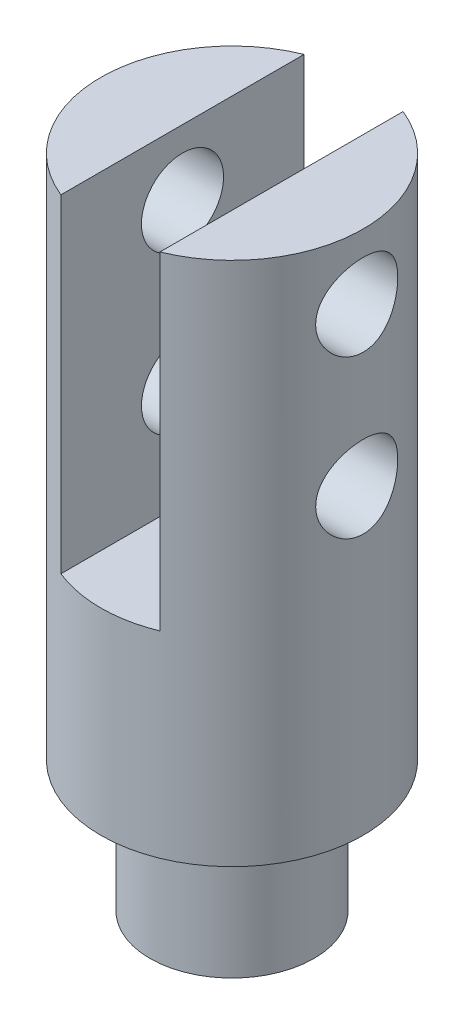
ISO-10303-21;
HEADER;
FILE_DESCRIPTION(('STEP AP214'),'2;1');
FILE_NAME('part.step','',(''),(''),'','','');
FILE_SCHEMA(('AUTOMOTIVE_DESIGN { 1 0 10303 214 1 1 1 1 }'));
ENDSEC;
DATA;
#1=APPLICATION_CONTEXT('core data for automotive mechanical design processes');
#2=APPLICATION_PROTOCOL_DEFINITION('international standard','automotive_design',2000,#1);
#3=PRODUCT_CONTEXT('',#1,'mechanical');
#4=PRODUCT('Part','Part','',(#3));
#5=PRODUCT_RELATED_PRODUCT_CATEGORY('part','',(#4));
#6=PRODUCT_DEFINITION_FORMATION('','',#4);
#7=PRODUCT_DEFINITION_CONTEXT('part definition',#1,'design');
#8=PRODUCT_DEFINITION('design','',#6,#7);
#9=PRODUCT_DEFINITION_SHAPE('','',#8);
#10=(LENGTH_UNIT() NAMED_UNIT(*) SI_UNIT(.MILLI.,.METRE.));
#11=(NAMED_UNIT(*) PLANE_ANGLE_UNIT() SI_UNIT($,.RADIAN.));
#12=(NAMED_UNIT(*) SI_UNIT($,.STERADIAN.) SOLID_ANGLE_UNIT());
#13=UNCERTAINTY_MEASURE_WITH_UNIT(LENGTH_MEASURE(1.E-05),#10,'distance_accuracy_value','');
#14=(GEOMETRIC_REPRESENTATION_CONTEXT(3) GLOBAL_UNCERTAINTY_ASSIGNED_CONTEXT((#13)) GLOBAL_UNIT_ASSIGNED_CONTEXT((#10,
#11,#12)) REPRESENTATION_CONTEXT('',''));
#15=CARTESIAN_POINT('',(0.,0.,0.));
#16=DIRECTION('',(0.,0.,1.));
#17=DIRECTION('',(1.,0.,0.));
#18=AXIS2_PLACEMENT_3D('',#15,#16,#17);
#19=CARTESIAN_POINT('',(0.,0.,0.));
#20=DIRECTION('',(0.,1.,0.));
#21=DIRECTION('',(0.,0.,1.));
#22=AXIS2_PLACEMENT_3D('',#19,#20,#21);
#23=PLANE('',#22);
#24=DIRECTION('',(0.,0.,-1.));
#25=VECTOR('',#24,1.);
#26=CARTESIAN_POINT('',(4.7879,0.,26.2227099301437));
#27=LINE('',#26,#25);
#28=CARTESIAN_POINT('',(4.7879,0.,11.7629083814336));
#29=VERTEX_POINT('',#28);
#30=CARTESIAN_POINT('',(4.7879,0.,-11.7629083814336));
#31=VERTEX_POINT('',#30);
#32=EDGE_CURVE('E89',#29,#31,#27,.T.);
#33=ORIENTED_EDGE('',*,*,#32,.F.);
#34=CARTESIAN_POINT('',(0.,0.,0.));
#35=DIRECTION('',(0.,1.,0.));
#36=DIRECTION('',(0.,0.,1.));
#37=AXIS2_PLACEMENT_3D('',#34,#35,#36);
#38=CIRCLE('',#37,12.7);
#39=EDGE_CURVE('E96',#29,#31,#38,.T.);
#40=ORIENTED_EDGE('',*,*,#39,.T.);
#41=EDGE_LOOP('',(#33,#40));
#42=FACE_BOUND('',#41,.T.);
#43=ADVANCED_FACE('F46',(#42),#23,.T.);
#44=DIRECTION('',(0.,0.,1.));
#45=VECTOR('',#44,1.);
#46=CARTESIAN_POINT('',(-4.7879,0.,26.2227099301437));
#47=LINE('',#46,#45);
#48=CARTESIAN_POINT('',(-4.7879,0.,-11.7629083814336));
#49=VERTEX_POINT('',#48);
#50=CARTESIAN_POINT('',(-4.7879,0.,11.7629083814336));
#51=VERTEX_POINT('',#50);
#52=EDGE_CURVE('E97',#49,#51,#47,.T.);
#53=ORIENTED_EDGE('',*,*,#52,.F.);
#54=EDGE_CURVE('E105',#49,#51,#38,.T.);
#55=ORIENTED_EDGE('',*,*,#54,.T.);
#56=EDGE_LOOP('',(#53,#55));
#57=FACE_BOUND('',#56,.T.);
#58=ADVANCED_FACE('F48',(#57),#23,.T.);
#59=CARTESIAN_POINT('',(0.,54.1051229508197,0.));
#60=DIRECTION('',(0.,1.,0.));
#61=DIRECTION('',(0.,0.,1.));
#62=AXIS2_PLACEMENT_3D('',#59,#60,#61);
#63=CYLINDRICAL_SURFACE('',#62,12.7);
#64=CARTESIAN_POINT('',(-12.7,-2.37744,0.));
#65=CARTESIAN_POINT('',(-12.6999989364852,-2.37744138791249,-0.217492557763878));
#66=CARTESIAN_POINT('',(-12.6943603110892,-2.39536000112773,-0.43499970457634));
#67=CARTESIAN_POINT('',(-12.6724191916379,-2.46637270695974,-0.863652552627288));
#68=CARTESIAN_POINT('',(-12.6561143024,-2.51947470027949,-1.07479681389357));
#69=CARTESIAN_POINT('',(-12.6146217111831,-2.6588878067983,-1.48448068440005));
#70=CARTESIAN_POINT('',(-12.5894477791866,-2.74514745856465,-1.68303927334254));
#71=CARTESIAN_POINT('',(-12.5328159290258,-2.94820815004892,-2.06287399242892));
#72=CARTESIAN_POINT('',(-12.5013570171812,-3.06501402014844,-2.2441473830109));
#73=CARTESIAN_POINT('',(-12.434405504797,-3.32965530098341,-2.58987502339287));
#74=CARTESIAN_POINT('',(-12.3988248999794,-3.47826499988978,-2.75371947787847));
#75=CARTESIAN_POINT('',(-12.3281495374864,-3.80064685931324,-3.05461377606018));
#76=CARTESIAN_POINT('',(-12.2930548716153,-3.97442370525733,-3.19165861921905));
#77=CARTESIAN_POINT('',(-12.2263802746652,-4.34748898232327,-3.43837247280718));
#78=CARTESIAN_POINT('',(-12.1949089417569,-4.54730273264139,-3.54727926216575));
#79=CARTESIAN_POINT('',(-12.1403681406173,-4.96355279542945,-3.72969053094531));
#80=CARTESIAN_POINT('',(-12.1172964547123,-5.17998470207569,-3.80320435646769));
#81=CARTESIAN_POINT('',(-12.0830878271828,-5.61644554014773,-3.91051080755888));
#82=CARTESIAN_POINT('',(-12.0716118578883,-5.83616901477066,-3.94543476323751));
#83=CARTESIAN_POINT('',(-12.0608874846081,-6.27863327561589,-3.97810456397336));
#84=CARTESIAN_POINT('',(-12.0616358227427,-6.50137324210696,-3.97586031466403));
#85=CARTESIAN_POINT('',(-12.0749762843099,-6.93418525877417,-3.93514217597677));
#86=CARTESIAN_POINT('',(-12.087098059951,-7.1444095994836,-3.89810699023441));
#87=CARTESIAN_POINT('',(-12.1210554098322,-7.55549695839661,-3.79119112966301));
#88=CARTESIAN_POINT('',(-12.142892018231,-7.75635897745129,-3.72130695796479));
#89=CARTESIAN_POINT('',(-12.1941787219778,-8.14644504195209,-3.54966190182948));
#90=CARTESIAN_POINT('',(-12.2237355296374,-8.33545582985697,-3.44744961529387));
#91=CARTESIAN_POINT('',(-12.2870834938587,-8.69411470789891,-3.21436326003549));
#92=CARTESIAN_POINT('',(-12.3208757511563,-8.86375774263885,-3.08348173393025));
#93=CARTESIAN_POINT('',(-12.3907734671559,-9.1869984375376,-2.78971448911799));
#94=CARTESIAN_POINT('',(-12.4269141304001,-9.33951122177774,-2.62564123753074));
#95=CARTESIAN_POINT('',(-12.496077188252,-9.61512130845667,-2.27379788611728));
#96=CARTESIAN_POINT('',(-12.5290993508445,-9.73821642327437,-2.08602602554894));
#97=CARTESIAN_POINT('',(-12.5886526113865,-9.95223396566114,-1.69002189927923));
#98=CARTESIAN_POINT('',(-12.615130911478,-10.0428971859756,-1.48164107002917));
#99=CARTESIAN_POINT('',(-12.6582318933316,-10.187560916962,-1.05156492180258));
#100=CARTESIAN_POINT('',(-12.6748575734968,-10.241572582362,-0.829873676166752));
#101=CARTESIAN_POINT('',(-12.6958973744177,-10.3095509256056,-0.388678056186915));
#102=CARTESIAN_POINT('',(-12.7007591131408,-10.3249862243419,-0.169420979767007));
#103=CARTESIAN_POINT('',(-12.699047355392,-10.3195150470694,0.268574231623304));
#104=CARTESIAN_POINT('',(-12.6924755329623,-10.2986138912544,0.487312437868517));
#105=CARTESIAN_POINT('',(-12.6689292134884,-10.2222418730986,0.912393047829627));
#106=CARTESIAN_POINT('',(-12.6522179733833,-10.1676452722643,1.11890850891783));
#107=CARTESIAN_POINT('',(-12.6103486256779,-10.0264993070627,1.51978981464501));
#108=CARTESIAN_POINT('',(-12.5851894743012,-9.93994599417147,1.71415415443784));
#109=CARTESIAN_POINT('',(-12.5282468497323,-9.73498197711441,2.09049282048022));
#110=CARTESIAN_POINT('',(-12.4963166747063,-9.61584524162483,2.27204892256562));
#111=CARTESIAN_POINT('',(-12.4294826490376,-9.34996705404039,2.61308445363422));
#112=CARTESIAN_POINT('',(-12.3945779918333,-9.20321810149365,2.77255786369947));
#113=CARTESIAN_POINT('',(-12.3239844248312,-8.87937364357529,3.07147417537215));
#114=CARTESIAN_POINT('',(-12.2883194045385,-8.70130456189332,3.20987033295593));
#115=CARTESIAN_POINT('',(-12.2216926111029,-8.32369495443146,3.45491105869465));
#116=CARTESIAN_POINT('',(-12.1907307645994,-8.12415476364334,3.56155612213168));
#117=CARTESIAN_POINT('',(-12.1373588401913,-7.70967306391737,3.7394065462174));
#118=CARTESIAN_POINT('',(-12.1149159152886,-7.49479458581322,3.81074835817004));
#119=CARTESIAN_POINT('',(-12.0813163108925,-7.05522861295752,3.9159809635055));
#120=CARTESIAN_POINT('',(-12.070155326175,-6.83054489408704,3.9498860433205));
#121=CARTESIAN_POINT('',(-12.0608324695137,-6.38869066565558,3.97825560084036));
#122=CARTESIAN_POINT('',(-12.062104519437,-6.1716410092991,3.97443753066441));
#123=CARTESIAN_POINT('',(-12.0761289096867,-5.74143784306023,3.93161628411661));
#124=CARTESIAN_POINT('',(-12.0888807125414,-5.52828415124905,3.89261475500183));
#125=CARTESIAN_POINT('',(-12.1240318794813,-5.11500121092369,3.78168430417645));
#126=CARTESIAN_POINT('',(-12.1462866983272,-4.91472658333173,3.71024774286122));
#127=CARTESIAN_POINT('',(-12.1978991973409,-4.52884612131617,3.53686292923591));
#128=CARTESIAN_POINT('',(-12.2272583240984,-4.34324328460893,3.43490846182106));
#129=CARTESIAN_POINT('',(-12.2912067958949,-3.98410156989901,3.19870947726234));
#130=CARTESIAN_POINT('',(-12.3259560124056,-3.81132045239107,3.06335617834633));
#131=CARTESIAN_POINT('',(-12.3960349657771,-3.49036779598578,2.76615169588709));
#132=CARTESIAN_POINT('',(-12.43136485575,-3.34220286611897,2.60429341929131));
#133=CARTESIAN_POINT('',(-12.5000119585414,-3.06983228211151,2.25229799874578));
#134=CARTESIAN_POINT('',(-12.5332254124341,-2.94656982318234,2.06140852836853));
#135=CARTESIAN_POINT('',(-12.5925940830216,-2.73404722162869,1.6605794856469));
#136=CARTESIAN_POINT('',(-12.6187520601081,-2.64477377546746,1.45064740663411));
#137=CARTESIAN_POINT('',(-12.6592504823893,-2.50920890104685,1.03589988887822));
#138=CARTESIAN_POINT('',(-12.674398700637,-2.45993813677705,0.832134597580989));
#139=CARTESIAN_POINT('',(-12.6947729630997,-2.39405633740357,0.41891660491495));
#140=CARTESIAN_POINT('',(-12.7000010242612,-2.37743866331433,0.209465068448066));
#141=CARTESIAN_POINT('',(-12.7,-2.37744,0.));
#142=B_SPLINE_CURVE_WITH_KNOTS('',3,(#64,#65,#66,#67,#68,#69,#70,#71,#72,#73,#74,#75,#76,#77,
#78,#79,#80,#81,#82,#83,#84,#85,#86,#87,#88,#89,#90,#91,#92,#93,#94,#95,#96,#97,#98,#99,#100,
#101,#102,#103,#104,#105,#106,#107,#108,#109,#110,#111,#112,#113,#114,#115,#116,#117,#118,#119,
#120,#121,#122,#123,#124,#125,#126,#127,#128,#129,#130,#131,#132,#133,#134,#135,#136,#137,#138,
#139,#140,#141),.UNSPECIFIED.,.T.,.F.,(4,2,2,2,2,2,2,2,2,2,2,2,2,2,2,2,2,2,2,2,2,2,2,2,2,2,2,2,
2,2,2,2,2,2,2,2,2,2,4),(0.,0.651707735300668,1.30356186628947,1.9544083633484,2.60535784336777,
3.2744551875713,3.94367725971725,4.6294766958225,5.31509493570358,5.98003087291569,
6.64478960206365,7.28321492869985,7.92170823294808,8.56954277091646,9.21754602277983,
9.89510763680892,10.5727196214891,11.2556323060653,11.9383370560521,12.594625460782,
13.2508177832876,13.8906613923976,14.5305840861059,15.1861264828991,15.8418472058662,
16.5236038200059,17.2053497989362,17.8844397552653,18.5632704707704,19.2113432651236,
19.8593857188815,20.4979038526516,21.1365521120022,21.8002269495809,22.4640796856973,
23.1496659626656,23.8349836198352,24.4627649579607,25.0904186431553),.UNSPECIFIED.);
#143=CARTESIAN_POINT('',(-12.7,-2.37744,0.));
#144=VERTEX_POINT('',#143);
#145=EDGE_CURVE('E98',#144,#144,#142,.T.);
#146=ORIENTED_EDGE('',*,*,#145,.F.);
#147=EDGE_LOOP('',(#146));
#148=FACE_BOUND('',#147,.T.);
#149=CARTESIAN_POINT('',(12.0627014821059,-6.35,-3.97256));
#150=CARTESIAN_POINT('',(12.0627027961794,-6.1328014116811,-3.97255856310129));
#151=CARTESIAN_POINT('',(12.0686319145908,-5.91558819013561,-3.9546866204507));
#152=CARTESIAN_POINT('',(12.0916026560791,-5.48754390676897,-3.88387609666546));
#153=CARTESIAN_POINT('',(12.1086472651352,-5.27671457579608,-3.83092809290926));
#154=CARTESIAN_POINT('',(12.151733687867,-4.86770022532404,-3.69196471501516));
#155=CARTESIAN_POINT('',(12.177759548921,-4.66949351983241,-3.60600794117009));
#156=CARTESIAN_POINT('',(12.2358538393342,-4.29025909529024,-3.40366261620942));
#157=CARTESIAN_POINT('',(12.2679233397837,-4.10923442990888,-3.28726866941442));
#158=CARTESIAN_POINT('',(12.3357294758176,-3.76327207579501,-3.0230627709514));
#159=CARTESIAN_POINT('',(12.3715493244807,-3.59901278367133,-2.87438364518377));
#160=CARTESIAN_POINT('',(12.4421121709539,-3.29730488218388,-2.55168336334861));
#161=CARTESIAN_POINT('',(12.4768550175283,-3.15986002396383,-2.37765866755945));
#162=CARTESIAN_POINT('',(12.5423012936835,-2.9126877385371,-2.00433093566138));
#163=CARTESIAN_POINT('',(12.5728953234145,-2.80365912650236,-1.80454436598342));
#164=CARTESIAN_POINT('',(12.6256249951138,-2.62101558695137,-1.38834990171707));
#165=CARTESIAN_POINT('',(12.6477626289638,-2.5473923187407,-1.17194593575396));
#166=CARTESIAN_POINT('',(12.6804961935347,-2.43991497719421,-0.735762867909985));
#167=CARTESIAN_POINT('',(12.6914279026824,-2.40490137292181,-0.516295138671484));
#168=CARTESIAN_POINT('',(12.7017039066272,-2.37196320664494,-0.0743459833627602));
#169=CARTESIAN_POINT('',(12.7010508403752,-2.37403019787731,0.148134744824027));
#170=CARTESIAN_POINT('',(12.6884645894265,-2.41443214938406,0.581632908143987));
#171=CARTESIAN_POINT('',(12.6769223774942,-2.45151008863624,0.792780663294784));
#172=CARTESIAN_POINT('',(12.6443357310436,-2.55881865657165,1.20569070482151));
#173=CARTESIAN_POINT('',(12.6232906764193,-2.62905144878121,1.40745237776282));
#174=CARTESIAN_POINT('',(12.5735385181353,-2.80148270802431,1.79876115661538));
#175=CARTESIAN_POINT('',(12.5447406908756,-2.90406230656547,1.98812830542386));
#176=CARTESIAN_POINT('',(12.4825166385278,-3.137969442559,2.34735212904115));
#177=CARTESIAN_POINT('',(12.4490892421003,-3.26930426034461,2.51720384623838));
#178=CARTESIAN_POINT('',(12.3795164475622,-3.56344567216257,2.8400704159051));
#179=CARTESIAN_POINT('',(12.3433158389733,-3.72733730226057,2.99208624562731));
#180=CARTESIAN_POINT('',(12.2734806830765,-4.07862522252041,3.26677379487549));
#181=CARTESIAN_POINT('',(12.239846439547,-4.26602428831702,3.38944204421229));
#182=CARTESIAN_POINT('',(12.1786733891543,-4.66183500541037,3.60311772524955));
#183=CARTESIAN_POINT('',(12.1512072163646,-4.87045884890678,3.69375443428513));
#184=CARTESIAN_POINT('',(12.1063320884953,-5.30107422021659,3.83829620438531));
#185=CARTESIAN_POINT('',(12.0889195120697,-5.52306090282515,3.89221449283095));
#186=CARTESIAN_POINT('',(12.0669271388999,-5.96452772533215,3.95986001038957));
#187=CARTESIAN_POINT('',(12.061859113871,-6.18374923098028,3.97511732261505));
#188=CARTESIAN_POINT('',(12.0637740199026,-6.62163542974182,3.96930373197379));
#189=CARTESIAN_POINT('',(12.0707550844942,-6.84030020384132,3.9482384556727));
#190=CARTESIAN_POINT('',(12.0954994954556,-7.26427318135323,3.87174517337134));
#191=CARTESIAN_POINT('',(12.1129443996281,-7.46978482128579,3.81733103647696));
#192=CARTESIAN_POINT('',(12.1563133173933,-7.86873785457212,3.67687538646103));
#193=CARTESIAN_POINT('',(12.1822387155875,-8.06217727076107,3.59082870844302));
#194=CARTESIAN_POINT('',(12.2405718748575,-8.43764368473302,3.38673027946662));
#195=CARTESIAN_POINT('',(12.2731444369954,-8.61918330808252,3.26783025311601));
#196=CARTESIAN_POINT('',(12.3407609000887,-8.96029082174931,3.00239016107204));
#197=CARTESIAN_POINT('',(12.3758054427688,-9.11985297475027,2.85584290151663));
#198=CARTESIAN_POINT('',(12.4461785640103,-9.41931305155079,2.53202783311835));
#199=CARTESIAN_POINT('',(12.4814584813061,-9.55811893459465,2.35373685340041));
#200=CARTESIAN_POINT('',(12.5468728034526,-9.8038851711639,1.97553942683843));
#201=CARTESIAN_POINT('',(12.5770074433862,-9.91084697978206,1.77563396822211));
#202=CARTESIAN_POINT('',(12.628564136677,-10.088863319273,1.36111026800587));
#203=CARTESIAN_POINT('',(12.6500489695962,-10.1601775265454,1.14661175504248));
#204=CARTESIAN_POINT('',(12.682161350964,-10.2654817662206,0.707874785633673));
#205=CARTESIAN_POINT('',(12.6927923041024,-10.2994835032037,0.483639406512681));
#206=CARTESIAN_POINT('',(12.7017730874969,-10.328245358304,0.0418454583490813));
#207=CARTESIAN_POINT('',(12.7006165610339,-10.3245827474622,-0.175601606140479));
#208=CARTESIAN_POINT('',(12.6873351980789,-10.2819352178962,-0.606642268059739));
#209=CARTESIAN_POINT('',(12.6752110790507,-10.2429526096893,-0.820236116621895));
#210=CARTESIAN_POINT('',(12.6415133332292,-10.1317765691931,-1.2348723203477));
#211=CARTESIAN_POINT('',(12.6200602203846,-10.0600061183378,-1.43603856480608));
#212=CARTESIAN_POINT('',(12.5699169003506,-9.88567391483367,-1.82357071830948));
#213=CARTESIAN_POINT('',(12.5412254508483,-9.78310687600334,-2.00993407951481));
#214=CARTESIAN_POINT('',(12.4783861846941,-9.54606433729466,-2.36945773200867));
#215=CARTESIAN_POINT('',(12.4440861461251,-9.4106234222484,-2.54195462168637));
#216=CARTESIAN_POINT('',(12.3743360478658,-9.11337966785593,-2.8622955421123));
#217=CARTESIAN_POINT('',(12.3388856463222,-8.95156893365666,-3.01013216292368));
#218=CARTESIAN_POINT('',(12.2694505882544,-8.59973731966918,-3.28191133410888));
#219=CARTESIAN_POINT('',(12.2355537207499,-8.4089579821783,-3.40489719600126));
#220=CARTESIAN_POINT('',(12.1745663544634,-8.00841930528113,-3.61692863151599));
#221=CARTESIAN_POINT('',(12.1474731173528,-7.79866764824759,-3.70598786742965));
#222=CARTESIAN_POINT('',(12.1053693118272,-7.38440106970992,-3.84117521600551));
#223=CARTESIAN_POINT('',(12.0895300101337,-7.18094616382303,-3.89029956312878));
#224=CARTESIAN_POINT('',(12.0681967431713,-6.76833107883764,-3.95598861642747));
#225=CARTESIAN_POINT('',(12.0627002165921,-6.55917232527348,-3.97256138380017));
#226=CARTESIAN_POINT('',(12.0627014821059,-6.35,-3.97256));
#227=B_SPLINE_CURVE_WITH_KNOTS('',3,(#149,#150,#151,#152,#153,#154,#155,#156,#157,#158,#159,
#160,#161,#162,#163,#164,#165,#166,#167,#168,#169,#170,#171,#172,#173,#174,#175,#176,#177,#178,
#179,#180,#181,#182,#183,#184,#185,#186,#187,#188,#189,#190,#191,#192,#193,#194,#195,#196,#197,
#198,#199,#200,#201,#202,#203,#204,#205,#206,#207,#208,#209,#210,#211,#212,#213,#214,#215,#216,
#217,#218,#219,#220,#221,#222,#223,#224,#225,#226),.UNSPECIFIED.,.T.,.F.,(4,2,2,2,2,2,2,2,2,2,2,
2,2,2,2,2,2,2,2,2,2,2,2,2,2,2,2,2,2,2,2,2,2,2,2,2,2,2,4),(0.,0.650823065553643,1.30182103522614,
1.95166859496758,2.60163143311805,3.2718794320224,3.94222112660542,4.62775599462304,
5.31312928699614,5.9773058803367,6.64133117969034,7.28238713481386,7.92348492795103,
8.57243810432638,9.22155577501555,9.89777455807484,10.5740732607921,11.2579609346512,
11.9416021154774,12.5977316209682,13.253759497576,13.8907693124233,14.5278831831561,
15.1832964780732,15.8388805485644,16.5216946490341,17.2044775439993,17.8822114305849,
18.5597326574265,19.2090008617428,19.8582265961503,20.4993036791531,21.1404908649057,
21.8034551456627,22.4666182769928,23.1518073531519,23.8367202104603,24.4636483153288,
25.090421145747),.UNSPECIFIED.);
#228=CARTESIAN_POINT('',(12.0627014821059,-6.35,-3.97256));
#229=VERTEX_POINT('',#228);
#230=EDGE_CURVE('E206',#229,#229,#227,.T.);
#231=ORIENTED_EDGE('',*,*,#230,.F.);
#232=EDGE_LOOP('',(#231));
#233=FACE_BOUND('',#232,.T.);
#234=CARTESIAN_POINT('',(-12.7,-17.62125,0.));
#235=CARTESIAN_POINT('',(-12.6999989166262,-17.6212514179156,-0.217294412929185));
#236=CARTESIAN_POINT('',(-12.6943705657687,-17.6391545455486,-0.434603691696578));
#237=CARTESIAN_POINT('',(-12.6724693873196,-17.7101063168871,-0.862867240443323));
#238=CARTESIAN_POINT('',(-12.6561941503455,-17.7631629158318,-1.07382006065476));
#239=CARTESIAN_POINT('',(-12.6147771484086,-17.9024577535465,-1.48313312609131));
#240=CARTESIAN_POINT('',(-12.589649112594,-17.9886446317732,-1.68151231192993));
#241=CARTESIAN_POINT('',(-12.5331210208647,-18.1915349836287,-2.06100299745001));
#242=CARTESIAN_POINT('',(-12.5017199768221,-18.3082432659034,-2.24211177003752));
#243=CARTESIAN_POINT('',(-12.4348942862538,-18.5726577746551,-2.58751493847349));
#244=CARTESIAN_POINT('',(-12.3993819806814,-18.7211363100689,-2.75120108939738));
#245=CARTESIAN_POINT('',(-12.3288439723815,-19.043232145913,-3.05180168796747));
#246=CARTESIAN_POINT('',(-12.2938183613714,-19.2168541160451,-3.18871115145341));
#247=CARTESIAN_POINT('',(-12.2272788441653,-19.5895739900908,-3.4351701833388));
#248=CARTESIAN_POINT('',(-12.1958731285757,-19.7891954911493,-3.5439598967664));
#249=CARTESIAN_POINT('',(-12.141447707132,-20.2050406000671,-3.72617177918452));
#250=CARTESIAN_POINT('',(-12.1184257926095,-20.4212598171443,-3.79960326475997));
#251=CARTESIAN_POINT('',(-12.0842915217349,-20.8572991459117,-3.90678860277786));
#252=CARTESIAN_POINT('',(-12.0728413904273,-21.0768147285585,-3.94167074274712));
#253=CARTESIAN_POINT('',(-12.0621442508097,-21.5188581525402,-3.97429212242695));
#254=CARTESIAN_POINT('',(-12.062893998283,-21.7413851773397,-3.97204123662538));
#255=CARTESIAN_POINT('',(-12.0762137528427,-22.1738014113807,-3.93134293525445));
#256=CARTESIAN_POINT('',(-12.0883153493259,-22.383842474694,-3.89432983731616));
#257=CARTESIAN_POINT('',(-12.1222143133603,-22.7945700970855,-3.78748332400532));
#258=CARTESIAN_POINT('',(-12.144012711345,-22.9952556594939,-3.71764642055649));
#259=CARTESIAN_POINT('',(-12.1952081477563,-23.384992423548,-3.5461217711417));
#260=CARTESIAN_POINT('',(-12.2247115380623,-23.5738308389402,-3.44398363977409));
#261=CARTESIAN_POINT('',(-12.287943946336,-23.9321586630231,-3.21106865842369));
#262=CARTESIAN_POINT('',(-12.3216740610048,-24.1016430280574,-3.08028436905926));
#263=CARTESIAN_POINT('',(-12.3914385076889,-24.424560445347,-2.7867513295291));
#264=CARTESIAN_POINT('',(-12.427507834987,-24.57691159595,-2.62281851163243));
#265=CARTESIAN_POINT('',(-12.4965323716104,-24.852223262116,-2.27128199570308));
#266=CARTESIAN_POINT('',(-12.5294873501166,-24.9751816002711,-2.08367654558308));
#267=CARTESIAN_POINT('',(-12.5889161127652,-25.1889504113089,-1.68803513822788));
#268=CARTESIAN_POINT('',(-12.615337375581,-25.2795028300981,-1.47985132946873));
#269=CARTESIAN_POINT('',(-12.6583425975561,-25.4239807777038,-1.05018832945988));
#270=CARTESIAN_POINT('',(-12.6749295435735,-25.4779174281069,-0.828713197550627));
#271=CARTESIAN_POINT('',(-12.6959166132918,-25.5457897851883,-0.387937874396849));
#272=CARTESIAN_POINT('',(-12.7007627269301,-25.5611901259094,-0.168884119904577));
#273=CARTESIAN_POINT('',(-12.6990411414587,-25.5556822304265,0.268701220700962));
#274=CARTESIAN_POINT('',(-12.692475109701,-25.5347792982507,0.487232878423167));
#275=CARTESIAN_POINT('',(-12.6689600496899,-25.4584339934747,0.911921382198321));
#276=CARTESIAN_POINT('',(-12.6522731812643,-25.4038631253304,1.11825080648648));
#277=CARTESIAN_POINT('',(-12.6104688537924,-25.2627944312357,1.51876737413487));
#278=CARTESIAN_POINT('',(-12.5853503535804,-25.1762926622206,1.71295301442576));
#279=CARTESIAN_POINT('',(-12.5285037326117,-24.9714600374579,2.0889353911842));
#280=CARTESIAN_POINT('',(-12.4966294014609,-24.8524046146976,2.27031467382624));
#281=CARTESIAN_POINT('',(-12.4299157676089,-24.5867135578772,2.61101157679883));
#282=CARTESIAN_POINT('',(-12.3950756621704,-24.4400704436608,2.77032319328954));
#283=CARTESIAN_POINT('',(-12.3246195875397,-24.1164780240846,3.06891519476789));
#284=CARTESIAN_POINT('',(-12.2890275779295,-23.938558092628,3.20715171178012));
#285=CARTESIAN_POINT('',(-12.2225418202855,-23.5612729930037,3.45189969528356));
#286=CARTESIAN_POINT('',(-12.1916479976341,-23.3619081655143,3.55841166565639));
#287=CARTESIAN_POINT('',(-12.1383990890051,-22.9478040761362,3.73602515050722));
#288=CARTESIAN_POINT('',(-12.1160110218308,-22.7331281130416,3.8072637709034));
#289=CARTESIAN_POINT('',(-12.0824996743068,-22.2939848339356,3.91232689459936));
#290=CARTESIAN_POINT('',(-12.071372107564,-22.0695212776093,3.94616563489433));
#291=CARTESIAN_POINT('',(-12.0620882936656,-21.6280870219321,3.97444614552049));
#292=CARTESIAN_POINT('',(-12.0633681960545,-21.4112365340344,3.97060037798693));
#293=CARTESIAN_POINT('',(-12.0773853694349,-20.9814331928093,3.92775497559047));
#294=CARTESIAN_POINT('',(-12.0901221059534,-20.7684801581346,3.88875698061476));
#295=CARTESIAN_POINT('',(-12.1252238503226,-20.3555789242957,3.77786042475736));
#296=CARTESIAN_POINT('',(-12.1474451675406,-20.1554859745286,3.70645189639076));
#297=CARTESIAN_POINT('',(-12.1989756100824,-19.7699616870295,3.53314721788623));
#298=CARTESIAN_POINT('',(-12.2282861769408,-19.5845333414011,3.43124486610452));
#299=CARTESIAN_POINT('',(-12.2921232133137,-19.2257490438536,3.19518268167841));
#300=CARTESIAN_POINT('',(-12.3268088783039,-19.0531491888367,3.0599168393912));
#301=CARTESIAN_POINT('',(-12.3967557125734,-18.7325434082444,2.76291356358524));
#302=CARTESIAN_POINT('',(-12.4320170335113,-18.5845440824534,2.60116904944344));
#303=CARTESIAN_POINT('',(-12.500523384491,-18.3125029406977,2.24944515446412));
#304=CARTESIAN_POINT('',(-12.5336649799489,-18.1894012117714,2.05871627399745));
#305=CARTESIAN_POINT('',(-12.5928999251759,-17.9771709444322,1.65823626319334));
#306=CARTESIAN_POINT('',(-12.6189960445273,-17.8880290506997,1.44849265100055));
#307=CARTESIAN_POINT('',(-12.6593806607877,-17.7527224078431,1.03424874231238));
#308=CARTESIAN_POINT('',(-12.674480645595,-17.7035622963056,0.830803320332334));
#309=CARTESIAN_POINT('',(-12.6947898358103,-17.6378287071025,0.418242418022786));
#310=CARTESIAN_POINT('',(-12.7000010426587,-17.6212486353723,0.209128093743467));
#311=CARTESIAN_POINT('',(-12.7,-17.62125,0.));
#312=B_SPLINE_CURVE_WITH_KNOTS('',3,(#234,#235,#236,#237,#238,#239,#240,#241,#242,#243,#244,
#245,#246,#247,#248,#249,#250,#251,#252,#253,#254,#255,#256,#257,#258,#259,#260,#261,#262,#263,
#264,#265,#266,#267,#268,#269,#270,#271,#272,#273,#274,#275,#276,#277,#278,#279,#280,#281,#282,
#283,#284,#285,#286,#287,#288,#289,#290,#291,#292,#293,#294,#295,#296,#297,#298,#299,#300,#301,
#302,#303,#304,#305,#306,#307,#308,#309,#310,#311),.UNSPECIFIED.,.T.,.F.,(4,2,2,2,2,2,2,2,2,2,2,
2,2,2,2,2,2,2,2,2,2,2,2,2,2,2,2,2,2,2,2,2,2,2,2,2,2,2,4),(0.,0.651114551948219,1.30237650163329,
1.95263287146774,2.60299175094789,3.27145085469628,3.94003426594302,4.62514223710794,
5.31006958937499,5.97437051780892,6.63849479687064,7.27636712817898,7.91430725938283,
8.56156665642489,9.20899434587646,9.88589422617488,10.56284423542,11.2450708769478,
11.9270902077497,12.5827653014541,13.2383446069148,13.8776273984988,14.5169891598929,
15.17193831049,15.8270653013166,16.5081514741898,17.1892268287804,17.8676336752166,
18.5457821837881,19.1932624606433,19.8407125334477,20.478683750695,21.1167848028337,
21.7798495700527,22.4430919369543,23.1279912133643,23.8126208620069,24.4393922140371,
25.0660366970775),.UNSPECIFIED.);
#313=CARTESIAN_POINT('',(-12.7,-17.62125,0.));
#314=VERTEX_POINT('',#313);
#315=EDGE_CURVE('E128',#314,#314,#312,.T.);
#316=ORIENTED_EDGE('',*,*,#315,.F.);
#317=EDGE_LOOP('',(#316));
#318=FACE_BOUND('',#317,.T.);
#319=CARTESIAN_POINT('',(12.0639555468967,-21.59,-3.96875));
#320=CARTESIAN_POINT('',(12.0639568842915,-21.3729981603529,-3.9687485325165));
#321=CARTESIAN_POINT('',(12.0698746252851,-21.1559814093673,-3.95089185662995));
#322=CARTESIAN_POINT('',(12.0928015382143,-20.728323539213,-3.88014131899213));
#323=CARTESIAN_POINT('',(12.1098137074621,-20.5176841590754,-3.82723798884485));
#324=CARTESIAN_POINT('',(12.1528185580417,-20.1090374363659,-3.68839077609799));
#325=CARTESIAN_POINT('',(12.1787953399195,-19.9110084598895,-3.60250535963949));
#326=CARTESIAN_POINT('',(12.2367803974433,-19.5321151906318,-3.40032702499773));
#327=CARTESIAN_POINT('',(12.2687897383379,-19.3512539378766,-3.28402873500381));
#328=CARTESIAN_POINT('',(12.3364665534787,-19.0056170957082,-3.02004752422578));
#329=CARTESIAN_POINT('',(12.3722169174668,-18.8415180400407,-2.87149984411226));
#330=CARTESIAN_POINT('',(12.4426423060656,-18.5401076580608,-2.54908699749619));
#331=CARTESIAN_POINT('',(12.4773171799559,-18.4028000722001,-2.37521830174644));
#332=CARTESIAN_POINT('',(12.542632820135,-18.1558848749393,-2.00223727216643));
#333=CARTESIAN_POINT('',(12.5731646098682,-18.0469739903351,-1.8026429419513));
#334=CARTESIAN_POINT('',(12.6257860206983,-17.8645310417086,-1.38685343930956));
#335=CARTESIAN_POINT('',(12.6478776258324,-17.7909906620751,-1.17066218269639));
#336=CARTESIAN_POINT('',(12.6805428323124,-17.6836351682918,-0.73489933336736));
#337=CARTESIAN_POINT('',(12.6914509627465,-17.6486637444236,-0.515638146611585));
#338=CARTESIAN_POINT('',(12.7017016690635,-17.6157752000609,-0.0741070844008488));
#339=CARTESIAN_POINT('',(12.7010468740197,-17.6178496564107,0.14816209563955));
#340=CARTESIAN_POINT('',(12.6884784372079,-17.6582333257854,0.581261475126273));
#341=CARTESIAN_POINT('',(12.6769542933653,-17.6952890426538,0.792221663947055));
#342=CARTESIAN_POINT('',(12.6444210713078,-17.8025265933866,1.2047634761292));
#343=CARTESIAN_POINT('',(12.6234113745139,-17.87271058765,1.40634448690292));
#344=CARTESIAN_POINT('',(12.5737448464102,-18.0450178503125,1.7972979775163));
#345=CARTESIAN_POINT('',(12.5449975673293,-18.1475215171867,1.986490837852));
#346=CARTESIAN_POINT('',(12.4828847037847,-18.3812532415629,2.34538047290818));
#347=CARTESIAN_POINT('',(12.4495179522495,-18.5124885627659,2.51507230096488));
#348=CARTESIAN_POINT('',(12.3800765457896,-18.8063937904907,2.83761719258918));
#349=CARTESIAN_POINT('',(12.3439469905188,-18.9701457935578,2.98947379336682));
#350=CARTESIAN_POINT('',(12.2742520403678,-19.3211294483057,3.26386743274752));
#351=CARTESIAN_POINT('',(12.2406869478284,-19.5083638616244,3.38640101789399));
#352=CARTESIAN_POINT('',(12.1796443805944,-19.903812963591,3.59982976435593));
#353=CARTESIAN_POINT('',(12.1522391668376,-20.1122388235463,3.6903558622175));
#354=CARTESIAN_POINT('',(12.1074670626035,-20.5424388865984,3.83471248377108));
#355=CARTESIAN_POINT('',(12.090096565806,-20.7642082625671,3.8885561917888));
#356=CARTESIAN_POINT('',(12.0681611381735,-21.2052533494324,3.95609715466836));
#357=CARTESIAN_POINT('',(12.0631098080017,-21.4242713380466,3.97132030073623));
#358=CARTESIAN_POINT('',(12.0650342093526,-21.8617474292471,3.96547163781533));
#359=CARTESIAN_POINT('',(12.0720080824823,-22.0802056131214,3.94440543703716));
#360=CARTESIAN_POINT('',(12.0967169001143,-22.5037913418714,3.86793973404382));
#361=CARTESIAN_POINT('',(12.1141348427388,-22.7091216951856,3.81355063934748));
#362=CARTESIAN_POINT('',(12.1574333727713,-23.1077191895868,3.67316936373721));
#363=CARTESIAN_POINT('',(12.1833153403409,-23.3009843571746,3.58717202843405));
#364=CARTESIAN_POINT('',(12.2415471339902,-23.6760991735255,3.38320096332414));
#365=CARTESIAN_POINT('',(12.2740611607997,-23.8574624945071,3.26438093276173));
#366=CARTESIAN_POINT('',(12.3415535798866,-24.198231849699,2.99912534755837));
#367=CARTESIAN_POINT('',(12.3765326108584,-24.3576321613379,2.85268261914323));
#368=CARTESIAN_POINT('',(12.4467679551152,-24.6567654117732,2.5291191091177));
#369=CARTESIAN_POINT('',(12.4819756800704,-24.7954094709941,2.35097843807855));
#370=CARTESIAN_POINT('',(12.5472526500367,-25.040879062545,1.97310865744318));
#371=CARTESIAN_POINT('',(12.5773221303875,-25.1477060523125,1.77338053726987));
#372=CARTESIAN_POINT('',(12.6287629037303,-25.3254845358476,1.35923503657856));
#373=CARTESIAN_POINT('',(12.6501969360681,-25.3966957389037,1.14493733510092));
#374=CARTESIAN_POINT('',(12.6822277040923,-25.5018303100223,0.706619281629033));
#375=CARTESIAN_POINT('',(12.6928278310283,-25.5357653465901,0.482601994980629));
#376=CARTESIAN_POINT('',(12.7017717580916,-25.564436430555,0.041227173860252));
#377=CARTESIAN_POINT('',(12.7006073586846,-25.5607453292922,-0.176019434430209));
#378=CARTESIAN_POINT('',(12.6873310540733,-25.5180724999204,-0.606657479606313));
#379=CARTESIAN_POINT('',(12.6752198626356,-25.4790930727256,-0.820049166920131));
#380=CARTESIAN_POINT('',(12.6415663743223,-25.3679515207193,-1.23429750117651));
#381=CARTESIAN_POINT('',(12.6201439227365,-25.2962104950909,-1.4352775410771));
#382=CARTESIAN_POINT('',(12.5700772724174,-25.1219626236131,-1.82244500096279));
#383=CARTESIAN_POINT('',(12.5414318351506,-25.0194505008344,-2.00862987679648));
#384=CARTESIAN_POINT('',(12.4786992260472,-24.7825489922564,-2.36779338152876));
#385=CARTESIAN_POINT('',(12.444460434593,-24.6471963161769,-2.54010987739363));
#386=CARTESIAN_POINT('',(12.3748398853692,-24.350154851017,-2.86010601269284));
#387=CARTESIAN_POINT('',(12.3394577881682,-24.1884581821074,-3.00777825387571));
#388=CARTESIAN_POINT('',(12.2701650893336,-23.8368975895045,-3.27923099268227));
#389=CARTESIAN_POINT('',(12.2363420774147,-23.6462779451049,-3.40205783883207));
#390=CARTESIAN_POINT('',(12.1754939776251,-23.2460859681455,-3.61379994626556));
#391=CARTESIAN_POINT('',(12.148466141849,-23.0365213435205,-3.70272892306258));
#392=CARTESIAN_POINT('',(12.1064832939804,-22.6227556900259,-3.83765997883641));
#393=CARTESIAN_POINT('',(12.090695752639,-22.4196194118413,-3.88667433985248));
#394=CARTESIAN_POINT('',(12.0694325058161,-22.0076590830936,-3.95221605466116));
#395=CARTESIAN_POINT('',(12.0639542598257,-21.7988364466852,-3.96875141226471));
#396=CARTESIAN_POINT('',(12.0639555468967,-21.59,-3.96875));
#397=B_SPLINE_CURVE_WITH_KNOTS('',3,(#319,#320,#321,#322,#323,#324,#325,#326,#327,#328,#329,
#330,#331,#332,#333,#334,#335,#336,#337,#338,#339,#340,#341,#342,#343,#344,#345,#346,#347,#348,
#349,#350,#351,#352,#353,#354,#355,#356,#357,#358,#359,#360,#361,#362,#363,#364,#365,#366,#367,
#368,#369,#370,#371,#372,#373,#374,#375,#376,#377,#378,#379,#380,#381,#382,#383,#384,#385,#386,
#387,#388,#389,#390,#391,#392,#393,#394,#395,#396),.UNSPECIFIED.,.T.,.F.,(4,2,2,2,2,2,2,2,2,2,2,
2,2,2,2,2,2,2,2,2,2,2,2,2,2,2,2,2,2,2,2,2,2,2,2,2,2,2,4),(0.,0.65023408671646,1.30064391591466,
1.9499060700765,2.59928298063672,3.26888730748912,3.93858505338065,4.62342934734853,
5.30811255551902,5.97165820002819,6.63505297547884,7.27554370928958,7.91607621728546,
8.56444834631699,9.21298458114371,9.88854826126036,10.5641914653574,11.2473889522044,
11.9303407555771,12.5858566319692,13.2412712130333,13.8777336124857,14.5142998466166,
15.1691217226574,15.8241138944544,16.5062515255927,17.1883579053947,17.8654150975664,
18.5422602910408,19.1909319775321,19.839561371558,20.4800786269208,21.1207057872722,
21.7830620061678,22.4456167093443,23.1301225072563,23.8143510505986,24.4402722513687,
25.066039186821),.UNSPECIFIED.);
#398=CARTESIAN_POINT('',(12.0639555468967,-21.59,-3.96875));
#399=VERTEX_POINT('',#398);
#400=EDGE_CURVE('E123',#399,#399,#397,.T.);
#401=ORIENTED_EDGE('',*,*,#400,.F.);
#402=EDGE_LOOP('',(#401));
#403=FACE_BOUND('',#402,.T.);
#404=DIRECTION('',(0.,1.,0.));
#405=VECTOR('',#404,1.);
#406=CARTESIAN_POINT('',(4.7879,54.1051229508197,11.7629083814336));
#407=LINE('',#406,#405);
#408=CARTESIAN_POINT('',(4.7879,-31.75,11.7629083814336));
#409=VERTEX_POINT('',#408);
#410=EDGE_CURVE('E13',#409,#29,#407,.T.);
#411=ORIENTED_EDGE('',*,*,#410,.F.);
#412=CARTESIAN_POINT('',(0.,-31.75,0.));
#413=DIRECTION('',(0.,-1.,0.));
#414=DIRECTION('',(0.,0.,-1.));
#415=AXIS2_PLACEMENT_3D('',#412,#413,#414);
#416=CIRCLE('',#415,12.7);
#417=CARTESIAN_POINT('',(-4.7879,-31.75,11.7629083814336));
#418=VERTEX_POINT('',#417);
#419=EDGE_CURVE('E109',#418,#409,#416,.F.);
#420=ORIENTED_EDGE('',*,*,#419,.F.);
#421=DIRECTION('',(0.,1.,0.));
#422=VECTOR('',#421,1.);
#423=CARTESIAN_POINT('',(-4.7879,54.1051229508197,11.7629083814336));
#424=LINE('',#423,#422);
#425=EDGE_CURVE('E55',#51,#418,#424,.F.);
#426=ORIENTED_EDGE('',*,*,#425,.F.);
#427=ORIENTED_EDGE('',*,*,#54,.F.);
#428=DIRECTION('',(0.,1.,0.));
#429=VECTOR('',#428,1.);
#430=CARTESIAN_POINT('',(-4.7879,54.1051229508197,-11.7629083814336));
#431=LINE('',#430,#429);
#432=CARTESIAN_POINT('',(-4.7879,-31.75,-11.7629083814336));
#433=VERTEX_POINT('',#432);
#434=EDGE_CURVE('E107',#433,#49,#431,.T.);
#435=ORIENTED_EDGE('',*,*,#434,.F.);
#436=CARTESIAN_POINT('',(4.7879,-31.75,-11.7629083814336));
#437=VERTEX_POINT('',#436);
#438=EDGE_CURVE('E104',#437,#433,#416,.F.);
#439=ORIENTED_EDGE('',*,*,#438,.F.);
#440=DIRECTION('',(0.,1.,0.));
#441=VECTOR('',#440,1.);
#442=CARTESIAN_POINT('',(4.7879,54.1051229508197,-11.7629083814336));
#443=LINE('',#442,#441);
#444=EDGE_CURVE('E103',#31,#437,#443,.F.);
#445=ORIENTED_EDGE('',*,*,#444,.F.);
#446=ORIENTED_EDGE('',*,*,#39,.F.);
#447=EDGE_LOOP('',(#411,#420,#426,#427,#435,#439,#445,#446));
#448=FACE_BOUND('',#447,.T.);
#449=CARTESIAN_POINT('',(0.,-50.8,0.));
#450=DIRECTION('',(0.,1.,0.));
#451=DIRECTION('',(0.,0.,1.));
#452=AXIS2_PLACEMENT_3D('',#449,#450,#451);
#453=CIRCLE('',#452,12.7);
#454=CARTESIAN_POINT('',(0.,-50.8,12.7));
#455=VERTEX_POINT('',#454);
#456=EDGE_CURVE('E111',#455,#455,#453,.T.);
#457=ORIENTED_EDGE('',*,*,#456,.T.);
#458=EDGE_LOOP('',(#457));
#459=FACE_BOUND('',#458,.T.);
#460=ADVANCED_FACE('F100',(#148,#233,#318,#403,#448,#459),#63,.T.);
#461=CARTESIAN_POINT('',(0.,-50.8,12.7));
#462=DIRECTION('',(0.,-1.,0.));
#463=DIRECTION('',(0.,0.,-1.));
#464=AXIS2_PLACEMENT_3D('',#461,#462,#463);
#465=PLANE('',#464);
#466=CARTESIAN_POINT('',(0.,-50.8,0.));
#467=DIRECTION('',(0.,1.,0.));
#468=DIRECTION('',(0.,0.,1.));
#469=AXIS2_PLACEMENT_3D('',#466,#467,#468);
#470=CIRCLE('',#469,7.9375);
#471=CARTESIAN_POINT('',(0.,-50.8,7.9375));
#472=VERTEX_POINT('',#471);
#473=EDGE_CURVE('E193',#472,#472,#470,.T.);
#474=ORIENTED_EDGE('',*,*,#473,.T.);
#475=EDGE_LOOP('',(#474));
#476=FACE_BOUND('',#475,.T.);
#477=ORIENTED_EDGE('',*,*,#456,.F.);
#478=EDGE_LOOP('',(#477));
#479=FACE_BOUND('',#478,.T.);
#480=ADVANCED_FACE('F168',(#476,#479),#465,.T.);
#481=CARTESIAN_POINT('',(0.,54.1051229508197,0.));
#482=DIRECTION('',(0.,1.,0.));
#483=DIRECTION('',(0.,0.,1.));
#484=AXIS2_PLACEMENT_3D('',#481,#482,#483);
#485=CYLINDRICAL_SURFACE('',#484,7.9375);
#486=CARTESIAN_POINT('',(0.,-63.5,0.));
#487=DIRECTION('',(0.,1.,0.));
#488=DIRECTION('',(0.,0.,1.));
#489=AXIS2_PLACEMENT_3D('',#486,#487,#488);
#490=CIRCLE('',#489,7.9375);
#491=CARTESIAN_POINT('',(0.,-63.5,7.9375));
#492=VERTEX_POINT('',#491);
#493=EDGE_CURVE('E190',#492,#492,#490,.T.);
#494=ORIENTED_EDGE('',*,*,#493,.T.);
#495=EDGE_LOOP('',(#494));
#496=FACE_BOUND('',#495,.T.);
#497=ORIENTED_EDGE('',*,*,#473,.F.);
#498=EDGE_LOOP('',(#497));
#499=FACE_BOUND('',#498,.T.);
#500=ADVANCED_FACE('F165',(#496,#499),#485,.T.);
#501=CARTESIAN_POINT('',(0.,-63.5,7.9375));
#502=DIRECTION('',(0.,-1.,0.));
#503=DIRECTION('',(0.,0.,-1.));
#504=AXIS2_PLACEMENT_3D('',#501,#502,#503);
#505=PLANE('',#504);
#506=ORIENTED_EDGE('',*,*,#493,.F.);
#507=EDGE_LOOP('',(#506));
#508=FACE_BOUND('',#507,.T.);
#509=ADVANCED_FACE('F161',(#508),#505,.T.);
#510=CARTESIAN_POINT('',(4.7879,-31.75,26.2227099301437));
#511=DIRECTION('',(1.,0.,0.));
#512=DIRECTION('',(0.,0.,-1.));
#513=AXIS2_PLACEMENT_3D('',#510,#511,#512);
#514=PLANE('',#513);
#515=CARTESIAN_POINT('',(4.7879,-6.35,0.));
#516=DIRECTION('',(1.,0.,0.));
#517=DIRECTION('',(0.,0.,-1.));
#518=AXIS2_PLACEMENT_3D('',#515,#516,#517);
#519=CIRCLE('',#518,3.97256);
#520=CARTESIAN_POINT('',(4.7879,-6.35,-3.97256));
#521=VERTEX_POINT('',#520);
#522=EDGE_CURVE('E211',#521,#521,#519,.T.);
#523=ORIENTED_EDGE('',*,*,#522,.T.);
#524=EDGE_LOOP('',(#523));
#525=FACE_BOUND('',#524,.T.);
#526=CARTESIAN_POINT('',(4.7879,-21.59,0.));
#527=DIRECTION('',(1.,0.,0.));
#528=DIRECTION('',(0.,0.,-1.));
#529=AXIS2_PLACEMENT_3D('',#526,#527,#528);
#530=CIRCLE('',#529,3.96875);
#531=CARTESIAN_POINT('',(4.7879,-21.59,-3.96875));
#532=VERTEX_POINT('',#531);
#533=EDGE_CURVE('E119',#532,#532,#530,.T.);
#534=ORIENTED_EDGE('',*,*,#533,.T.);
#535=EDGE_LOOP('',(#534));
#536=FACE_BOUND('',#535,.T.);
#537=ORIENTED_EDGE('',*,*,#444,.T.);
#538=DIRECTION('',(0.,0.,-1.));
#539=VECTOR('',#538,1.);
#540=CARTESIAN_POINT('',(4.7879,-31.75,26.2227099301437));
#541=LINE('',#540,#539);
#542=EDGE_CURVE('E63',#409,#437,#541,.T.);
#543=ORIENTED_EDGE('',*,*,#542,.F.);
#544=ORIENTED_EDGE('',*,*,#410,.T.);
#545=ORIENTED_EDGE('',*,*,#32,.T.);
#546=EDGE_LOOP('',(#537,#543,#544,#545));
#547=FACE_BOUND('',#546,.T.);
#548=ADVANCED_FACE('F88',(#525,#536,#547),#514,.F.);
#549=CARTESIAN_POINT('',(-4.7879,-31.75,26.2227099301437));
#550=DIRECTION('',(-1.,0.,0.));
#551=DIRECTION('',(0.,0.,1.));
#552=AXIS2_PLACEMENT_3D('',#549,#550,#551);
#553=PLANE('',#552);
#554=CARTESIAN_POINT('',(-4.7879,-6.35,0.));
#555=DIRECTION('',(-1.,0.,0.));
#556=DIRECTION('',(0.,0.,1.));
#557=AXIS2_PLACEMENT_3D('',#554,#555,#556);
#558=CIRCLE('',#557,3.97256);
#559=CARTESIAN_POINT('',(-4.7879,-6.35,3.97256));
#560=VERTEX_POINT('',#559);
#561=EDGE_CURVE('E50',#560,#560,#558,.T.);
#562=ORIENTED_EDGE('',*,*,#561,.T.);
#563=EDGE_LOOP('',(#562));
#564=FACE_BOUND('',#563,.T.);
#565=CARTESIAN_POINT('',(-4.7879,-21.59,0.));
#566=DIRECTION('',(-1.,0.,0.));
#567=DIRECTION('',(0.,0.,1.));
#568=AXIS2_PLACEMENT_3D('',#565,#566,#567);
#569=CIRCLE('',#568,3.96875);
#570=CARTESIAN_POINT('',(-4.7879,-21.59,3.96875));
#571=VERTEX_POINT('',#570);
#572=EDGE_CURVE('E117',#571,#571,#569,.T.);
#573=ORIENTED_EDGE('',*,*,#572,.T.);
#574=EDGE_LOOP('',(#573));
#575=FACE_BOUND('',#574,.T.);
#576=ORIENTED_EDGE('',*,*,#425,.T.);
#577=DIRECTION('',(0.,0.,1.));
#578=VECTOR('',#577,1.);
#579=CARTESIAN_POINT('',(-4.7879,-31.75,26.2227099301437));
#580=LINE('',#579,#578);
#581=EDGE_CURVE('E189',#433,#418,#580,.T.);
#582=ORIENTED_EDGE('',*,*,#581,.F.);
#583=ORIENTED_EDGE('',*,*,#434,.T.);
#584=ORIENTED_EDGE('',*,*,#52,.T.);
#585=EDGE_LOOP('',(#576,#582,#583,#584));
#586=FACE_BOUND('',#585,.T.);
#587=ADVANCED_FACE('F155',(#564,#575,#586),#553,.F.);
#588=CARTESIAN_POINT('',(0.,-31.75,0.));
#589=DIRECTION('',(0.,-1.,0.));
#590=DIRECTION('',(0.,0.,-1.));
#591=AXIS2_PLACEMENT_3D('',#588,#589,#590);
#592=PLANE('',#591);
#593=ORIENTED_EDGE('',*,*,#419,.T.);
#594=ORIENTED_EDGE('',*,*,#542,.T.);
#595=ORIENTED_EDGE('',*,*,#438,.T.);
#596=ORIENTED_EDGE('',*,*,#581,.T.);
#597=EDGE_LOOP('',(#593,#594,#595,#596));
#598=FACE_BOUND('',#597,.T.);
#599=ADVANCED_FACE('F151',(#598),#592,.F.);
#600=CARTESIAN_POINT('',(-12.7,-21.59,0.));
#601=DIRECTION('',(1.,0.,0.));
#602=DIRECTION('',(0.,0.,-1.));
#603=AXIS2_PLACEMENT_3D('',#600,#601,#602);
#604=CYLINDRICAL_SURFACE('',#603,3.96875);
#605=ORIENTED_EDGE('',*,*,#315,.T.);
#606=EDGE_LOOP('',(#605));
#607=FACE_BOUND('',#606,.T.);
#608=ORIENTED_EDGE('',*,*,#572,.F.);
#609=EDGE_LOOP('',(#608));
#610=FACE_BOUND('',#609,.T.);
#611=ADVANCED_FACE('F149',(#607,#610),#604,.F.);
#612=CARTESIAN_POINT('',(-12.7,-6.35,0.));
#613=DIRECTION('',(1.,0.,0.));
#614=DIRECTION('',(0.,0.,-1.));
#615=AXIS2_PLACEMENT_3D('',#612,#613,#614);
#616=CYLINDRICAL_SURFACE('',#615,3.97256);
#617=ORIENTED_EDGE('',*,*,#145,.T.);
#618=EDGE_LOOP('',(#617));
#619=FACE_BOUND('',#618,.T.);
#620=ORIENTED_EDGE('',*,*,#561,.F.);
#621=EDGE_LOOP('',(#620));
#622=FACE_BOUND('',#621,.T.);
#623=ADVANCED_FACE('F147',(#619,#622),#616,.F.);
#624=ORIENTED_EDGE('',*,*,#400,.T.);
#625=EDGE_LOOP('',(#624));
#626=FACE_BOUND('',#625,.T.);
#627=ORIENTED_EDGE('',*,*,#533,.F.);
#628=EDGE_LOOP('',(#627));
#629=FACE_BOUND('',#628,.T.);
#630=ADVANCED_FACE('F141',(#626,#629),#604,.F.);
#631=ORIENTED_EDGE('',*,*,#230,.T.);
#632=EDGE_LOOP('',(#631));
#633=FACE_BOUND('',#632,.T.);
#634=ORIENTED_EDGE('',*,*,#522,.F.);
#635=EDGE_LOOP('',(#634));
#636=FACE_BOUND('',#635,.T.);
#637=ADVANCED_FACE('F146',(#633,#636),#616,.F.);
#638=CLOSED_SHELL('',(#43,#58,#460,#480,#500,#509,#548,#587,#599,#611,#623,#630,#637));
#639=MANIFOLD_SOLID_BREP('B2',#638);
#640=ADVANCED_BREP_SHAPE_REPRESENTATION('',(#18,#639),#14);
#641=SHAPE_DEFINITION_REPRESENTATION(#9,#640);
ENDSEC;
END-ISO-10303-21;
